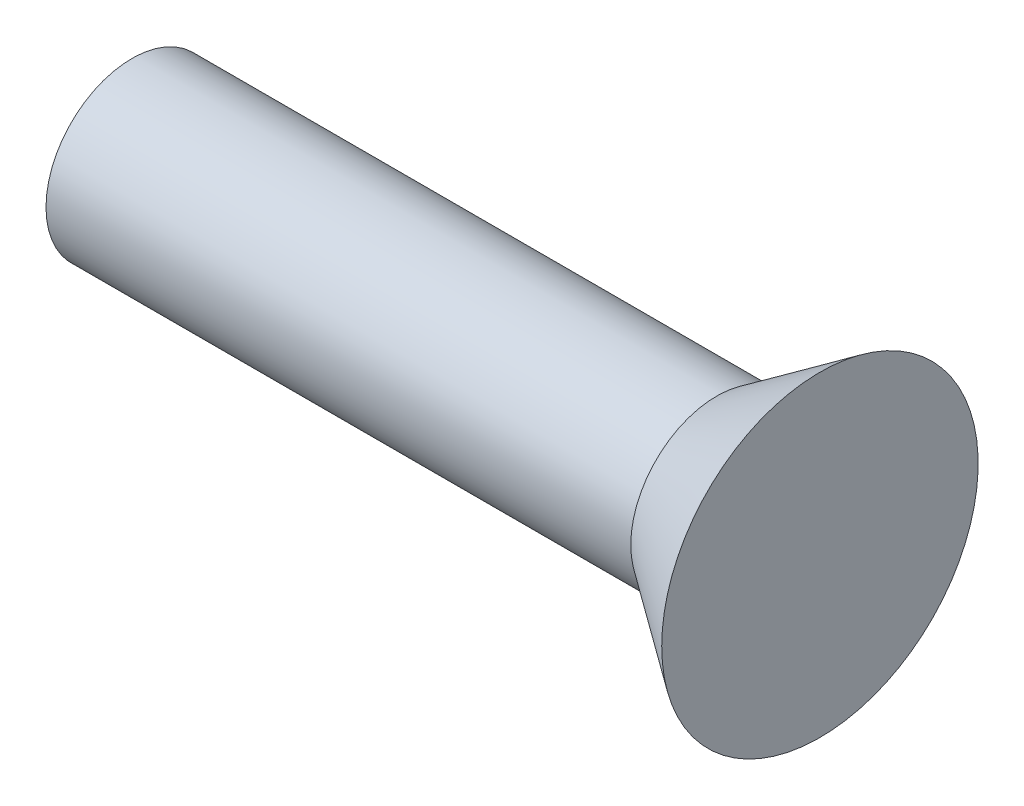
ISO-10303-21;
HEADER;
FILE_DESCRIPTION(('STEP AP214'),'2;1');
FILE_NAME('part.step','',(''),(''),'','','');
FILE_SCHEMA(('AUTOMOTIVE_DESIGN { 1 0 10303 214 1 1 1 1 }'));
ENDSEC;
DATA;
#1=APPLICATION_CONTEXT('core data for automotive mechanical design processes');
#2=APPLICATION_PROTOCOL_DEFINITION('international standard','automotive_design',2000,#1);
#3=PRODUCT_CONTEXT('',#1,'mechanical');
#4=PRODUCT('Part','Part','',(#3));
#5=PRODUCT_RELATED_PRODUCT_CATEGORY('part','',(#4));
#6=PRODUCT_DEFINITION_FORMATION('','',#4);
#7=PRODUCT_DEFINITION_CONTEXT('part definition',#1,'design');
#8=PRODUCT_DEFINITION('design','',#6,#7);
#9=PRODUCT_DEFINITION_SHAPE('','',#8);
#10=(LENGTH_UNIT() NAMED_UNIT(*) SI_UNIT(.MILLI.,.METRE.));
#11=(NAMED_UNIT(*) PLANE_ANGLE_UNIT() SI_UNIT($,.RADIAN.));
#12=(NAMED_UNIT(*) SI_UNIT($,.STERADIAN.) SOLID_ANGLE_UNIT());
#13=UNCERTAINTY_MEASURE_WITH_UNIT(LENGTH_MEASURE(1.E-05),#10,'distance_accuracy_value','');
#14=(GEOMETRIC_REPRESENTATION_CONTEXT(3) GLOBAL_UNCERTAINTY_ASSIGNED_CONTEXT((#13)) GLOBAL_UNIT_ASSIGNED_CONTEXT((#10,
#11,#12)) REPRESENTATION_CONTEXT('',''));
#15=CARTESIAN_POINT('',(0.,0.,0.));
#16=DIRECTION('',(0.,0.,1.));
#17=DIRECTION('',(1.,0.,0.));
#18=AXIS2_PLACEMENT_3D('',#15,#16,#17);
#19=CARTESIAN_POINT('',(0.,0.,0.));
#20=DIRECTION('',(1.,0.,0.));
#21=DIRECTION('',(0.,0.,-1.));
#22=AXIS2_PLACEMENT_3D('',#19,#20,#21);
#23=PLANE('',#22);
#24=CARTESIAN_POINT('',(0.,0.,0.));
#25=DIRECTION('',(-1.,0.,0.));
#26=DIRECTION('',(0.,0.,1.));
#27=AXIS2_PLACEMENT_3D('',#24,#25,#26);
#28=CIRCLE('',#27,1.25);
#29=CARTESIAN_POINT('',(0.,0.,1.25));
#30=VERTEX_POINT('',#29);
#31=EDGE_CURVE('E10',#30,#30,#28,.T.);
#32=ORIENTED_EDGE('',*,*,#31,.T.);
#33=EDGE_LOOP('',(#32));
#34=FACE_BOUND('',#33,.T.);
#35=ADVANCED_FACE('F35',(#34),#23,.F.);
#36=CARTESIAN_POINT('',(-53.8440891676821,0.,0.));
#37=DIRECTION('',(-1.,0.,0.));
#38=DIRECTION('',(0.,0.,1.));
#39=AXIS2_PLACEMENT_3D('',#36,#37,#38);
#40=CYLINDRICAL_SURFACE('',#39,1.25);
#41=ORIENTED_EDGE('',*,*,#31,.F.);
#42=EDGE_LOOP('',(#41));
#43=FACE_BOUND('',#42,.T.);
#44=CARTESIAN_POINT('',(8.5,0.,0.));
#45=DIRECTION('',(-1.,0.,0.));
#46=DIRECTION('',(0.,0.,1.));
#47=AXIS2_PLACEMENT_3D('',#44,#45,#46);
#48=CIRCLE('',#47,1.25);
#49=CARTESIAN_POINT('',(8.5,0.,1.25));
#50=VERTEX_POINT('',#49);
#51=EDGE_CURVE('E41',#50,#50,#48,.T.);
#52=ORIENTED_EDGE('',*,*,#51,.T.);
#53=EDGE_LOOP('',(#52));
#54=FACE_BOUND('',#53,.T.);
#55=ADVANCED_FACE('F60',(#43,#54),#40,.T.);
#56=CARTESIAN_POINT('',(9.99999999999999,0.,0.));
#57=DIRECTION('',(1.,0.,0.));
#58=DIRECTION('',(0.,0.,-1.));
#59=AXIS2_PLACEMENT_3D('',#56,#57,#58);
#60=CONICAL_SURFACE('',#59,2.3,0.61072596438921);
#61=ORIENTED_EDGE('',*,*,#51,.F.);
#62=EDGE_LOOP('',(#61));
#63=FACE_BOUND('',#62,.T.);
#64=CARTESIAN_POINT('',(9.99999999999999,0.,0.));
#65=DIRECTION('',(-1.,0.,0.));
#66=DIRECTION('',(0.,0.,1.));
#67=AXIS2_PLACEMENT_3D('',#64,#65,#66);
#68=CIRCLE('',#67,2.3);
#69=CARTESIAN_POINT('',(9.99999999999999,0.,2.3));
#70=VERTEX_POINT('',#69);
#71=EDGE_CURVE('E45',#70,#70,#68,.T.);
#72=ORIENTED_EDGE('',*,*,#71,.T.);
#73=EDGE_LOOP('',(#72));
#74=FACE_BOUND('',#73,.T.);
#75=ADVANCED_FACE('F52',(#63,#74),#60,.T.);
#76=CARTESIAN_POINT('',(10.,2.3,0.));
#77=DIRECTION('',(-1.,0.,0.));
#78=DIRECTION('',(0.,0.,1.));
#79=AXIS2_PLACEMENT_3D('',#76,#77,#78);
#80=PLANE('',#79);
#81=ORIENTED_EDGE('',*,*,#71,.F.);
#82=EDGE_LOOP('',(#81));
#83=FACE_BOUND('',#82,.T.);
#84=ADVANCED_FACE('F54',(#83),#80,.F.);
#85=CLOSED_SHELL('',(#35,#55,#75,#84));
#86=MANIFOLD_SOLID_BREP('B2',#85);
#87=ADVANCED_BREP_SHAPE_REPRESENTATION('',(#18,#86),#14);
#88=SHAPE_DEFINITION_REPRESENTATION(#9,#87);
ENDSEC;
END-ISO-10303-21;
